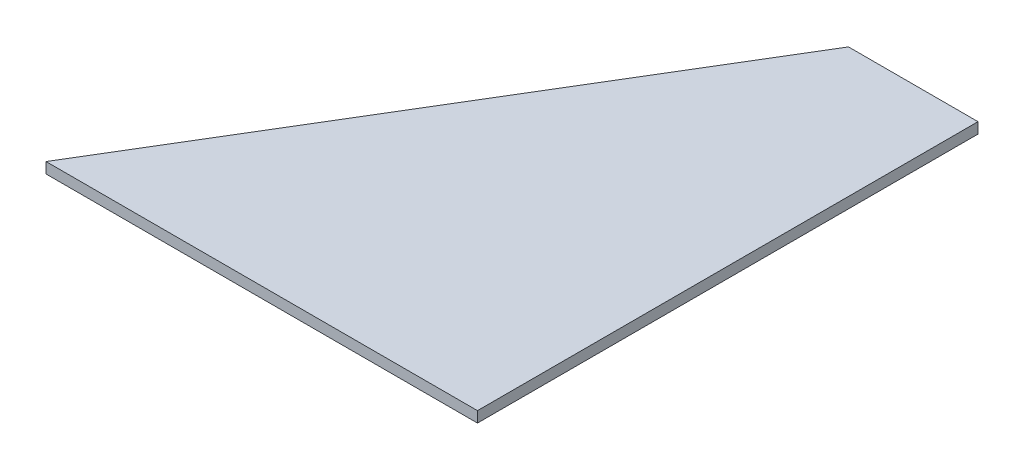
ISO-10303-21;
HEADER;
FILE_DESCRIPTION(('STEP AP214'),'2;1');
FILE_NAME('part.step','',(''),(''),'','','');
FILE_SCHEMA(('AUTOMOTIVE_DESIGN { 1 0 10303 214 1 1 1 1 }'));
ENDSEC;
DATA;
#1=APPLICATION_CONTEXT('core data for automotive mechanical design processes');
#2=APPLICATION_PROTOCOL_DEFINITION('international standard','automotive_design',2000,#1);
#3=PRODUCT_CONTEXT('',#1,'mechanical');
#4=PRODUCT('Part','Part','',(#3));
#5=PRODUCT_RELATED_PRODUCT_CATEGORY('part','',(#4));
#6=PRODUCT_DEFINITION_FORMATION('','',#4);
#7=PRODUCT_DEFINITION_CONTEXT('part definition',#1,'design');
#8=PRODUCT_DEFINITION('design','',#6,#7);
#9=PRODUCT_DEFINITION_SHAPE('','',#8);
#10=(LENGTH_UNIT() NAMED_UNIT(*) SI_UNIT(.MILLI.,.METRE.));
#11=(NAMED_UNIT(*) PLANE_ANGLE_UNIT() SI_UNIT($,.RADIAN.));
#12=(NAMED_UNIT(*) SI_UNIT($,.STERADIAN.) SOLID_ANGLE_UNIT());
#13=UNCERTAINTY_MEASURE_WITH_UNIT(LENGTH_MEASURE(1.E-05),#10,'distance_accuracy_value','');
#14=(GEOMETRIC_REPRESENTATION_CONTEXT(3) GLOBAL_UNCERTAINTY_ASSIGNED_CONTEXT((#13)) GLOBAL_UNIT_ASSIGNED_CONTEXT((#10,
#11,#12)) REPRESENTATION_CONTEXT('',''));
#15=CARTESIAN_POINT('',(0.,0.,0.));
#16=DIRECTION('',(0.,0.,1.));
#17=DIRECTION('',(1.,0.,0.));
#18=AXIS2_PLACEMENT_3D('',#15,#16,#17);
#19=CARTESIAN_POINT('',(-127.,3.175,0.));
#20=DIRECTION('',(0.,0.,-1.));
#21=DIRECTION('',(-1.,0.,0.));
#22=AXIS2_PLACEMENT_3D('',#19,#20,#21);
#23=PLANE('',#22);
#24=DIRECTION('',(1.,0.,0.));
#25=VECTOR('',#24,1.);
#26=CARTESIAN_POINT('',(-127.,0.,0.));
#27=LINE('',#26,#25);
#28=CARTESIAN_POINT('',(-127.,0.,0.));
#29=VERTEX_POINT('',#28);
#30=CARTESIAN_POINT('',(0.,0.,0.));
#31=VERTEX_POINT('',#30);
#32=EDGE_CURVE('E97',#29,#31,#27,.T.);
#33=ORIENTED_EDGE('',*,*,#32,.T.);
#34=DIRECTION('',(0.,-1.,0.));
#35=VECTOR('',#34,1.);
#36=CARTESIAN_POINT('',(0.,3.175,0.));
#37=LINE('',#36,#35);
#38=CARTESIAN_POINT('',(0.,3.175,0.));
#39=VERTEX_POINT('',#38);
#40=EDGE_CURVE('E11',#39,#31,#37,.T.);
#41=ORIENTED_EDGE('',*,*,#40,.F.);
#42=DIRECTION('',(1.,0.,0.));
#43=VECTOR('',#42,1.);
#44=CARTESIAN_POINT('',(-127.,3.175,0.));
#45=LINE('',#44,#43);
#46=CARTESIAN_POINT('',(-127.,3.175,0.));
#47=VERTEX_POINT('',#46);
#48=EDGE_CURVE('E85',#47,#39,#45,.T.);
#49=ORIENTED_EDGE('',*,*,#48,.F.);
#50=DIRECTION('',(0.,-1.,0.));
#51=VECTOR('',#50,1.);
#52=CARTESIAN_POINT('',(-127.,3.175,0.));
#53=LINE('',#52,#51);
#54=EDGE_CURVE('E93',#47,#29,#53,.T.);
#55=ORIENTED_EDGE('',*,*,#54,.T.);
#56=EDGE_LOOP('',(#33,#41,#49,#55));
#57=FACE_BOUND('',#56,.T.);
#58=ADVANCED_FACE('F34',(#57),#23,.F.);
#59=CARTESIAN_POINT('',(0.,3.175,0.));
#60=DIRECTION('',(-1.,0.,0.));
#61=DIRECTION('',(0.,0.,1.));
#62=AXIS2_PLACEMENT_3D('',#59,#60,#61);
#63=PLANE('',#62);
#64=DIRECTION('',(0.,0.,-1.));
#65=VECTOR('',#64,1.);
#66=CARTESIAN_POINT('',(0.,0.,0.));
#67=LINE('',#66,#65);
#68=CARTESIAN_POINT('',(0.,0.,-147.32));
#69=VERTEX_POINT('',#68);
#70=EDGE_CURVE('E89',#31,#69,#67,.T.);
#71=ORIENTED_EDGE('',*,*,#70,.T.);
#72=DIRECTION('',(0.,-1.,0.));
#73=VECTOR('',#72,1.);
#74=CARTESIAN_POINT('',(0.,3.175,-147.32));
#75=LINE('',#74,#73);
#76=CARTESIAN_POINT('',(0.,3.175,-147.32));
#77=VERTEX_POINT('',#76);
#78=EDGE_CURVE('E42',#77,#69,#75,.T.);
#79=ORIENTED_EDGE('',*,*,#78,.F.);
#80=DIRECTION('',(0.,0.,-1.));
#81=VECTOR('',#80,1.);
#82=CARTESIAN_POINT('',(0.,3.175,0.));
#83=LINE('',#82,#81);
#84=EDGE_CURVE('E80',#39,#77,#83,.T.);
#85=ORIENTED_EDGE('',*,*,#84,.F.);
#86=ORIENTED_EDGE('',*,*,#40,.T.);
#87=EDGE_LOOP('',(#71,#79,#85,#86));
#88=FACE_BOUND('',#87,.T.);
#89=ADVANCED_FACE('F88',(#88),#63,.F.);
#90=CARTESIAN_POINT('',(0.,3.175,-147.32));
#91=DIRECTION('',(0.,0.,1.));
#92=DIRECTION('',(1.,0.,0.));
#93=AXIS2_PLACEMENT_3D('',#90,#91,#92);
#94=PLANE('',#93);
#95=DIRECTION('',(-1.,0.,0.));
#96=VECTOR('',#95,1.);
#97=CARTESIAN_POINT('',(0.,0.,-147.32));
#98=LINE('',#97,#96);
#99=CARTESIAN_POINT('',(-38.1,0.,-147.32));
#100=VERTEX_POINT('',#99);
#101=EDGE_CURVE('E67',#69,#100,#98,.T.);
#102=ORIENTED_EDGE('',*,*,#101,.T.);
#103=DIRECTION('',(0.,-1.,0.));
#104=VECTOR('',#103,1.);
#105=CARTESIAN_POINT('',(-38.1,3.175,-147.32));
#106=LINE('',#105,#104);
#107=CARTESIAN_POINT('',(-38.1,3.175,-147.32));
#108=VERTEX_POINT('',#107);
#109=EDGE_CURVE('E90',#108,#100,#106,.T.);
#110=ORIENTED_EDGE('',*,*,#109,.F.);
#111=DIRECTION('',(-1.,0.,0.));
#112=VECTOR('',#111,1.);
#113=CARTESIAN_POINT('',(0.,3.175,-147.32));
#114=LINE('',#113,#112);
#115=EDGE_CURVE('E83',#77,#108,#114,.T.);
#116=ORIENTED_EDGE('',*,*,#115,.F.);
#117=ORIENTED_EDGE('',*,*,#78,.T.);
#118=EDGE_LOOP('',(#102,#110,#116,#117));
#119=FACE_BOUND('',#118,.T.);
#120=ADVANCED_FACE('F91',(#119),#94,.F.);
#121=CARTESIAN_POINT('',(-38.1,3.175,-147.32));
#122=DIRECTION('',(0.856187661065606,0.,0.516664967884418));
#123=DIRECTION('',(0.516664967884418,0.,-0.856187661065607));
#124=AXIS2_PLACEMENT_3D('',#121,#122,#123);
#125=PLANE('',#124);
#126=DIRECTION('',(-0.516664967884418,0.,0.856187661065606));
#127=VECTOR('',#126,1.);
#128=CARTESIAN_POINT('',(-38.1,0.,-147.32));
#129=LINE('',#128,#127);
#130=EDGE_CURVE('E73',#100,#29,#129,.T.);
#131=ORIENTED_EDGE('',*,*,#130,.T.);
#132=ORIENTED_EDGE('',*,*,#54,.F.);
#133=DIRECTION('',(-0.516664967884418,0.,0.856187661065606));
#134=VECTOR('',#133,1.);
#135=CARTESIAN_POINT('',(-38.1,3.175,-147.32));
#136=LINE('',#135,#134);
#137=EDGE_CURVE('E50',#108,#47,#136,.T.);
#138=ORIENTED_EDGE('',*,*,#137,.F.);
#139=ORIENTED_EDGE('',*,*,#109,.T.);
#140=EDGE_LOOP('',(#131,#132,#138,#139));
#141=FACE_BOUND('',#140,.T.);
#142=ADVANCED_FACE('F104',(#141),#125,.F.);
#143=CARTESIAN_POINT('',(0.,3.175,0.));
#144=DIRECTION('',(0.,1.,0.));
#145=DIRECTION('',(0.,0.,1.));
#146=AXIS2_PLACEMENT_3D('',#143,#144,#145);
#147=PLANE('',#146);
#148=ORIENTED_EDGE('',*,*,#48,.T.);
#149=ORIENTED_EDGE('',*,*,#84,.T.);
#150=ORIENTED_EDGE('',*,*,#115,.T.);
#151=ORIENTED_EDGE('',*,*,#137,.T.);
#152=EDGE_LOOP('',(#148,#149,#150,#151));
#153=FACE_BOUND('',#152,.T.);
#154=ADVANCED_FACE('F81',(#153),#147,.T.);
#155=CARTESIAN_POINT('',(0.,0.,0.));
#156=DIRECTION('',(0.,1.,0.));
#157=DIRECTION('',(0.,0.,1.));
#158=AXIS2_PLACEMENT_3D('',#155,#156,#157);
#159=PLANE('',#158);
#160=ORIENTED_EDGE('',*,*,#32,.F.);
#161=ORIENTED_EDGE('',*,*,#130,.F.);
#162=ORIENTED_EDGE('',*,*,#101,.F.);
#163=ORIENTED_EDGE('',*,*,#70,.F.);
#164=EDGE_LOOP('',(#160,#161,#162,#163));
#165=FACE_BOUND('',#164,.T.);
#166=ADVANCED_FACE('F107',(#165),#159,.F.);
#167=CLOSED_SHELL('',(#58,#89,#120,#142,#154,#166));
#168=MANIFOLD_SOLID_BREP('B2',#167);
#169=ADVANCED_BREP_SHAPE_REPRESENTATION('',(#18,#168),#14);
#170=SHAPE_DEFINITION_REPRESENTATION(#9,#169);
ENDSEC;
END-ISO-10303-21;
